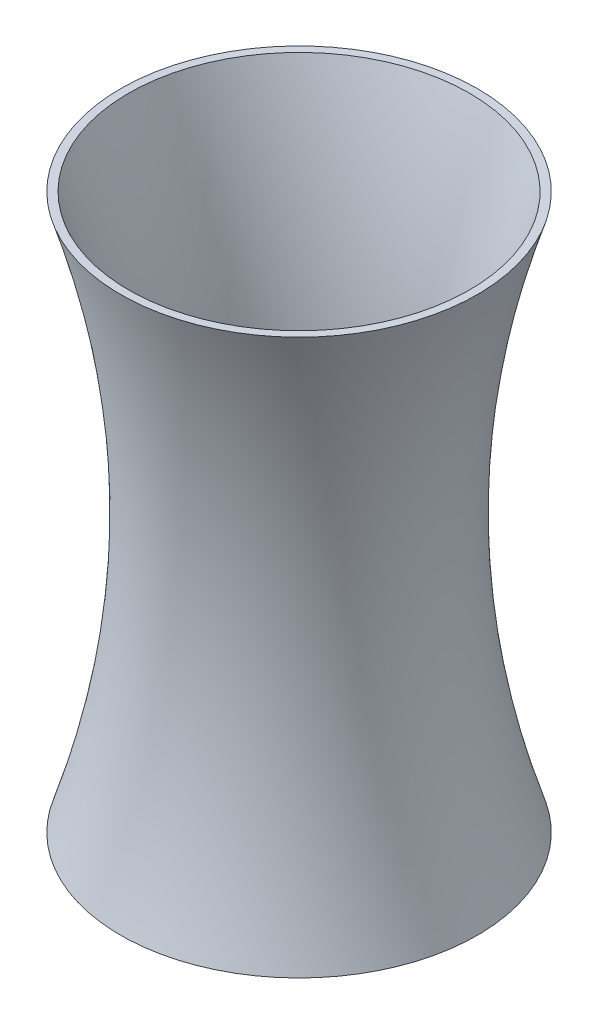
ISO-10303-21;
HEADER;
FILE_DESCRIPTION(('STEP AP214'),'2;1');
FILE_NAME('part.step','',(''),(''),'','','');
FILE_SCHEMA(('AUTOMOTIVE_DESIGN { 1 0 10303 214 1 1 1 1 }'));
ENDSEC;
DATA;
#1=APPLICATION_CONTEXT('core data for automotive mechanical design processes');
#2=APPLICATION_PROTOCOL_DEFINITION('international standard','automotive_design',2000,#1);
#3=PRODUCT_CONTEXT('',#1,'mechanical');
#4=PRODUCT('Part','Part','',(#3));
#5=PRODUCT_RELATED_PRODUCT_CATEGORY('part','',(#4));
#6=PRODUCT_DEFINITION_FORMATION('','',#4);
#7=PRODUCT_DEFINITION_CONTEXT('part definition',#1,'design');
#8=PRODUCT_DEFINITION('design','',#6,#7);
#9=PRODUCT_DEFINITION_SHAPE('','',#8);
#10=(LENGTH_UNIT() NAMED_UNIT(*) SI_UNIT(.MILLI.,.METRE.));
#11=(NAMED_UNIT(*) PLANE_ANGLE_UNIT() SI_UNIT($,.RADIAN.));
#12=(NAMED_UNIT(*) SI_UNIT($,.STERADIAN.) SOLID_ANGLE_UNIT());
#13=UNCERTAINTY_MEASURE_WITH_UNIT(LENGTH_MEASURE(1.E-05),#10,'distance_accuracy_value','');
#14=(GEOMETRIC_REPRESENTATION_CONTEXT(3) GLOBAL_UNCERTAINTY_ASSIGNED_CONTEXT((#13)) GLOBAL_UNIT_ASSIGNED_CONTEXT((#10,
#11,#12)) REPRESENTATION_CONTEXT('',''));
#15=CARTESIAN_POINT('',(0.,0.,0.));
#16=DIRECTION('',(0.,0.,1.));
#17=DIRECTION('',(1.,0.,0.));
#18=AXIS2_PLACEMENT_3D('',#15,#16,#17);
#19=CARTESIAN_POINT('',(-54.61,177.8,0.));
#20=CARTESIAN_POINT('',(-26.035,88.9,0.));
#21=CARTESIAN_POINT('',(-54.61,0.,0.));
#22=B_SPLINE_CURVE_WITH_KNOTS('',2,(#19,#20,#21),.UNSPECIFIED.,.F.,.F.,(3,3),(0.,1.),.UNSPECIFIED.);
#23=CARTESIAN_POINT('',(0.,0.,0.));
#24=DIRECTION('',(0.,-1.,0.));
#25=AXIS1_PLACEMENT('',#23,#24);
#26=SURFACE_OF_REVOLUTION('',#22,#25);
#27=CARTESIAN_POINT('',(0.,0.,0.));
#28=DIRECTION('',(0.,-1.,0.));
#29=DIRECTION('',(0.,0.,-1.));
#30=AXIS2_PLACEMENT_3D('',#27,#28,#29);
#31=CIRCLE('',#30,54.61);
#32=CARTESIAN_POINT('',(0.,0.,-54.61));
#33=VERTEX_POINT('',#32);
#34=EDGE_CURVE('E54',#33,#33,#31,.T.);
#35=ORIENTED_EDGE('',*,*,#34,.T.);
#36=EDGE_LOOP('',(#35));
#37=FACE_BOUND('',#36,.T.);
#38=CARTESIAN_POINT('',(0.,177.8,0.));
#39=DIRECTION('',(0.,-1.,0.));
#40=DIRECTION('',(0.,0.,-1.));
#41=AXIS2_PLACEMENT_3D('',#38,#39,#40);
#42=CIRCLE('',#41,54.61);
#43=CARTESIAN_POINT('',(0.,177.8,-54.61));
#44=VERTEX_POINT('',#43);
#45=EDGE_CURVE('E10',#44,#44,#42,.T.);
#46=ORIENTED_EDGE('',*,*,#45,.F.);
#47=EDGE_LOOP('',(#46));
#48=FACE_BOUND('',#47,.T.);
#49=ADVANCED_FACE('F39',(#37,#48),#26,.F.);
#50=CARTESIAN_POINT('',(0.,177.8,0.));
#51=DIRECTION('',(0.,-1.,0.));
#52=DIRECTION('',(0.,0.,-1.));
#53=AXIS2_PLACEMENT_3D('',#50,#51,#52);
#54=PLANE('',#53);
#55=CARTESIAN_POINT('',(0.,177.8,0.));
#56=DIRECTION('',(0.,-1.,0.));
#57=DIRECTION('',(0.,0.,-1.));
#58=AXIS2_PLACEMENT_3D('',#55,#56,#57);
#59=CIRCLE('',#58,57.15);
#60=CARTESIAN_POINT('',(0.,177.8,-57.15));
#61=VERTEX_POINT('',#60);
#62=EDGE_CURVE('E46',#61,#61,#59,.T.);
#63=ORIENTED_EDGE('',*,*,#62,.F.);
#64=EDGE_LOOP('',(#63));
#65=FACE_BOUND('',#64,.T.);
#66=ORIENTED_EDGE('',*,*,#45,.T.);
#67=EDGE_LOOP('',(#66));
#68=FACE_BOUND('',#67,.T.);
#69=ADVANCED_FACE('F73',(#65,#68),#54,.F.);
#70=CARTESIAN_POINT('',(-57.15,177.8,0.));
#71=CARTESIAN_POINT('',(-28.575,88.9,0.));
#72=CARTESIAN_POINT('',(-57.15,0.,0.));
#73=B_SPLINE_CURVE_WITH_KNOTS('',2,(#70,#71,#72),.UNSPECIFIED.,.F.,.F.,(3,3),(0.,1.),.UNSPECIFIED.);
#74=CARTESIAN_POINT('',(0.,0.,0.));
#75=DIRECTION('',(0.,-1.,0.));
#76=AXIS1_PLACEMENT('',#74,#75);
#77=SURFACE_OF_REVOLUTION('',#73,#76);
#78=CARTESIAN_POINT('',(0.,0.,0.));
#79=DIRECTION('',(0.,-1.,0.));
#80=DIRECTION('',(0.,0.,-1.));
#81=AXIS2_PLACEMENT_3D('',#78,#79,#80);
#82=CIRCLE('',#81,57.15);
#83=CARTESIAN_POINT('',(0.,0.,-57.15));
#84=VERTEX_POINT('',#83);
#85=EDGE_CURVE('E50',#84,#84,#82,.T.);
#86=ORIENTED_EDGE('',*,*,#85,.F.);
#87=EDGE_LOOP('',(#86));
#88=FACE_BOUND('',#87,.T.);
#89=ORIENTED_EDGE('',*,*,#62,.T.);
#90=EDGE_LOOP('',(#89));
#91=FACE_BOUND('',#90,.T.);
#92=ADVANCED_FACE('F69',(#88,#91),#77,.T.);
#93=CARTESIAN_POINT('',(0.,0.,0.));
#94=DIRECTION('',(0.,1.,0.));
#95=DIRECTION('',(0.,0.,1.));
#96=AXIS2_PLACEMENT_3D('',#93,#94,#95);
#97=PLANE('',#96);
#98=ORIENTED_EDGE('',*,*,#34,.F.);
#99=EDGE_LOOP('',(#98));
#100=FACE_BOUND('',#99,.T.);
#101=ORIENTED_EDGE('',*,*,#85,.T.);
#102=EDGE_LOOP('',(#101));
#103=FACE_BOUND('',#102,.T.);
#104=ADVANCED_FACE('F72',(#100,#103),#97,.F.);
#105=CLOSED_SHELL('',(#49,#69,#92,#104));
#106=MANIFOLD_SOLID_BREP('B2',#105);
#107=ADVANCED_BREP_SHAPE_REPRESENTATION('',(#18,#106),#14);
#108=SHAPE_DEFINITION_REPRESENTATION(#9,#107);
ENDSEC;
END-ISO-10303-21;
